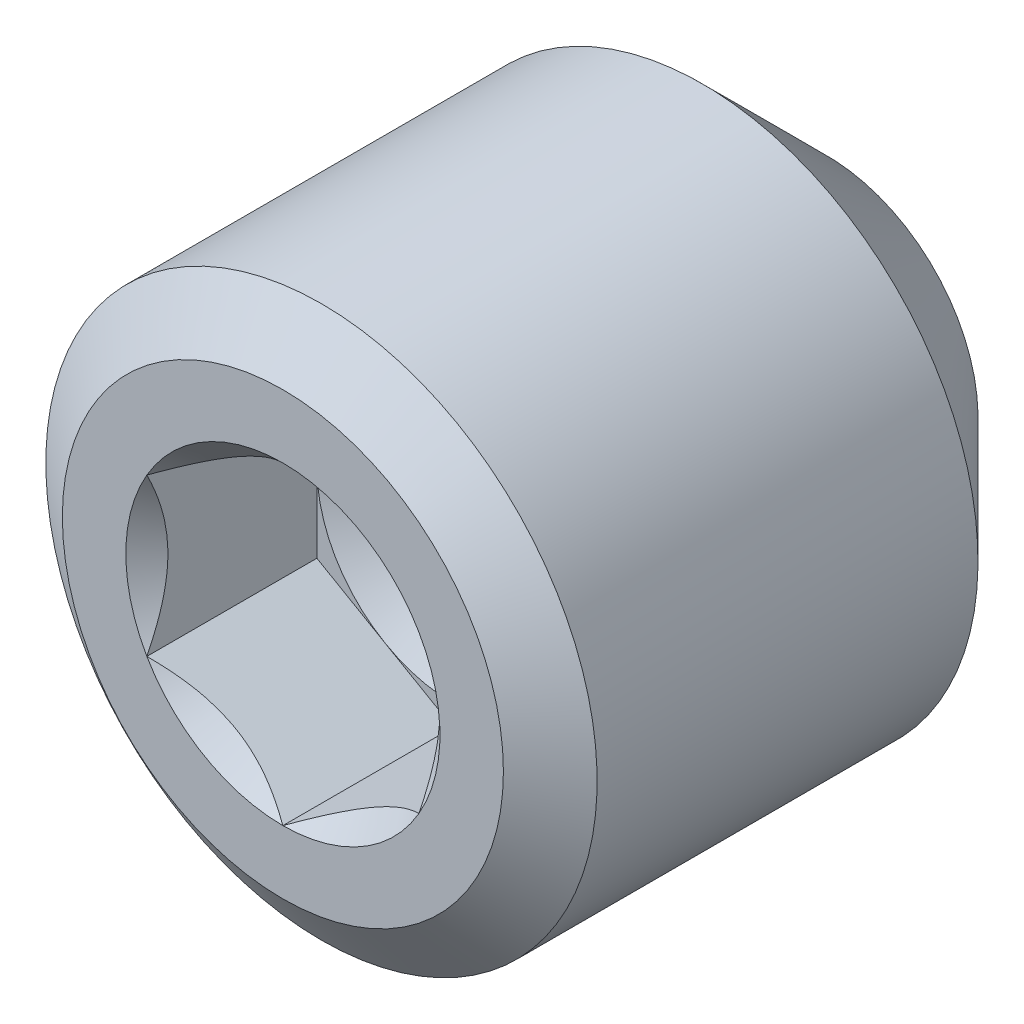
ISO-10303-21;
HEADER;
FILE_DESCRIPTION(('STEP AP214'),'2;1');
FILE_NAME('part.step','',(''),(''),'','','');
FILE_SCHEMA(('AUTOMOTIVE_DESIGN { 1 0 10303 214 1 1 1 1 }'));
ENDSEC;
DATA;
#1=APPLICATION_CONTEXT('core data for automotive mechanical design processes');
#2=APPLICATION_PROTOCOL_DEFINITION('international standard','automotive_design',2000,#1);
#3=PRODUCT_CONTEXT('',#1,'mechanical');
#4=PRODUCT('Part','Part','',(#3));
#5=PRODUCT_RELATED_PRODUCT_CATEGORY('part','',(#4));
#6=PRODUCT_DEFINITION_FORMATION('','',#4);
#7=PRODUCT_DEFINITION_CONTEXT('part definition',#1,'design');
#8=PRODUCT_DEFINITION('design','',#6,#7);
#9=PRODUCT_DEFINITION_SHAPE('','',#8);
#10=(LENGTH_UNIT() NAMED_UNIT(*) SI_UNIT(.MILLI.,.METRE.));
#11=(NAMED_UNIT(*) PLANE_ANGLE_UNIT() SI_UNIT($,.RADIAN.));
#12=(NAMED_UNIT(*) SI_UNIT($,.STERADIAN.) SOLID_ANGLE_UNIT());
#13=UNCERTAINTY_MEASURE_WITH_UNIT(LENGTH_MEASURE(1.E-05),#10,'distance_accuracy_value','');
#14=(GEOMETRIC_REPRESENTATION_CONTEXT(3) GLOBAL_UNCERTAINTY_ASSIGNED_CONTEXT((#13)) GLOBAL_UNIT_ASSIGNED_CONTEXT((#10,
#11,#12)) REPRESENTATION_CONTEXT('',''));
#15=CARTESIAN_POINT('',(0.,0.,0.));
#16=DIRECTION('',(0.,0.,1.));
#17=DIRECTION('',(1.,0.,0.));
#18=AXIS2_PLACEMENT_3D('',#15,#16,#17);
#19=CARTESIAN_POINT('',(0.,0.,0.495727982126937));
#20=DIRECTION('',(0.,0.,1.));
#21=DIRECTION('',(0.,-1.,0.));
#22=AXIS2_PLACEMENT_3D('',#19,#20,#21);
#23=CONICAL_SURFACE('',#22,1.19062499987876,1.04719755103086);
#24=CARTESIAN_POINT('',(2.55795384873636E-10,0.,-0.19167968210354));
#25=VERTEX_POINT('',#24);
#26=VERTEX_LOOP('',#25);
#27=FACE_BOUND('',#26,.T.);
#28=CARTESIAN_POINT('',(0.,0.,0.495727982192574));
#29=DIRECTION('',(0.,0.,1.));
#30=DIRECTION('',(0.,-1.,0.));
#31=AXIS2_PLACEMENT_3D('',#28,#29,#30);
#32=CIRCLE('',#31,1.19062499999245);
#33=CARTESIAN_POINT('',(1.19062499999623,0.,0.495727982183542));
#34=VERTEX_POINT('',#33);
#35=CARTESIAN_POINT('',(0.595312499998112,-1.03111149637757,0.495727982183542));
#36=VERTEX_POINT('',#35);
#37=EDGE_CURVE('E100',#34,#36,#32,.F.);
#38=ORIENTED_EDGE('',*,*,#37,.F.);
#39=CARTESIAN_POINT('',(0.,0.,0.495727982192574));
#40=DIRECTION('',(0.,0.,1.));
#41=DIRECTION('',(0.,-1.,0.));
#42=AXIS2_PLACEMENT_3D('',#39,#40,#41);
#43=CIRCLE('',#42,1.19062499999245);
#44=CARTESIAN_POINT('',(0.59531249999812,1.03111149637759,0.495727982183542));
#45=VERTEX_POINT('',#44);
#46=EDGE_CURVE('E114',#45,#34,#43,.F.);
#47=ORIENTED_EDGE('',*,*,#46,.F.);
#48=CARTESIAN_POINT('',(0.,0.,0.495727982192574));
#49=DIRECTION('',(0.,0.,1.));
#50=DIRECTION('',(0.,-1.,0.));
#51=AXIS2_PLACEMENT_3D('',#48,#49,#50);
#52=CIRCLE('',#51,1.19062499999245);
#53=CARTESIAN_POINT('',(-0.595312499998102,1.0311114963776,0.495727982183538));
#54=VERTEX_POINT('',#53);
#55=EDGE_CURVE('E252',#54,#45,#52,.F.);
#56=ORIENTED_EDGE('',*,*,#55,.F.);
#57=CARTESIAN_POINT('',(0.,0.,0.495727982192574));
#58=DIRECTION('',(0.,0.,1.));
#59=DIRECTION('',(0.,-1.,0.));
#60=AXIS2_PLACEMENT_3D('',#57,#58,#59);
#61=CIRCLE('',#60,1.19062499999245);
#62=CARTESIAN_POINT('',(-1.19062499999622,1.30013777685213E-13,0.495727982183538));
#63=VERTEX_POINT('',#62);
#64=EDGE_CURVE('E151',#63,#54,#61,.F.);
#65=ORIENTED_EDGE('',*,*,#64,.F.);
#66=CARTESIAN_POINT('',(0.,0.,0.495727982192574));
#67=DIRECTION('',(0.,0.,1.));
#68=DIRECTION('',(0.,-1.,0.));
#69=AXIS2_PLACEMENT_3D('',#66,#67,#68);
#70=CIRCLE('',#69,1.19062499999245);
#71=CARTESIAN_POINT('',(-0.595312499998087,-1.03111149637758,0.495727982183542));
#72=VERTEX_POINT('',#71);
#73=EDGE_CURVE('E19',#72,#63,#70,.F.);
#74=ORIENTED_EDGE('',*,*,#73,.F.);
#75=CARTESIAN_POINT('',(0.,0.,0.495727982192574));
#76=DIRECTION('',(0.,0.,1.));
#77=DIRECTION('',(0.,-1.,0.));
#78=AXIS2_PLACEMENT_3D('',#75,#76,#77);
#79=CIRCLE('',#78,1.19062499999245);
#80=EDGE_CURVE('E373',#36,#72,#79,.F.);
#81=ORIENTED_EDGE('',*,*,#80,.F.);
#82=EDGE_LOOP('',(#38,#47,#56,#65,#74,#81));
#83=FACE_BOUND('',#82,.T.);
#84=ADVANCED_FACE('F16',(#27,#83),#23,.F.);
#85=CARTESIAN_POINT('',(-1.190625,2.06222299276171,0.49572798217451));
#86=DIRECTION('',(0.,0.,1.));
#87=DIRECTION('',(0.,-1.,0.));
#88=AXIS2_PLACEMENT_3D('',#85,#86,#87);
#89=PLANE('',#88);
#90=DIRECTION('',(0.,-1.,0.));
#91=VECTOR('',#90,1.);
#92=CARTESIAN_POINT('',(-1.190625,0.687407664253913,0.49572798217451));
#93=LINE('',#92,#91);
#94=CARTESIAN_POINT('',(-1.19062500000001,-0.687407664253882,0.49572798217451));
#95=VERTEX_POINT('',#94);
#96=EDGE_CURVE('E83',#63,#95,#93,.T.);
#97=ORIENTED_EDGE('',*,*,#96,.T.);
#98=DIRECTION('',(0.866025403784438,-0.500000000000001,0.));
#99=VECTOR('',#98,1.);
#100=CARTESIAN_POINT('',(-1.190625,-0.687407664253889,0.49572798217451));
#101=LINE('',#100,#99);
#102=EDGE_CURVE('E167',#95,#72,#101,.T.);
#103=ORIENTED_EDGE('',*,*,#102,.T.);
#104=ORIENTED_EDGE('',*,*,#73,.T.);
#105=EDGE_LOOP('',(#97,#103,#104));
#106=FACE_BOUND('',#105,.T.);
#107=ADVANCED_FACE('F269',(#106),#89,.T.);
#108=CARTESIAN_POINT('',(-1.190625,2.06222299276171,0.49572798217451));
#109=DIRECTION('',(0.,0.,1.));
#110=DIRECTION('',(0.,-1.,0.));
#111=AXIS2_PLACEMENT_3D('',#108,#109,#110);
#112=PLANE('',#111);
#113=DIRECTION('',(0.866025403784438,-0.500000000000001,0.));
#114=VECTOR('',#113,1.);
#115=CARTESIAN_POINT('',(-1.190625,-0.687407664253889,0.495727982174503));
#116=LINE('',#115,#114);
#117=CARTESIAN_POINT('',(0.,-1.37481532850779,0.495727982174507));
#118=VERTEX_POINT('',#117);
#119=EDGE_CURVE('E133',#72,#118,#116,.T.);
#120=ORIENTED_EDGE('',*,*,#119,.T.);
#121=DIRECTION('',(0.866025403784439,0.5,0.));
#122=VECTOR('',#121,1.);
#123=CARTESIAN_POINT('',(0.,-1.37481532850779,0.49572798217451));
#124=LINE('',#123,#122);
#125=EDGE_CURVE('E105',#118,#36,#124,.T.);
#126=ORIENTED_EDGE('',*,*,#125,.T.);
#127=ORIENTED_EDGE('',*,*,#80,.T.);
#128=EDGE_LOOP('',(#120,#126,#127));
#129=FACE_BOUND('',#128,.T.);
#130=ADVANCED_FACE('F267',(#129),#112,.T.);
#131=CARTESIAN_POINT('',(-1.190625,2.06222299276171,0.49572798217451));
#132=DIRECTION('',(0.,0.,1.));
#133=DIRECTION('',(0.,-1.,0.));
#134=AXIS2_PLACEMENT_3D('',#131,#132,#133);
#135=PLANE('',#134);
#136=DIRECTION('',(0.866025403784439,0.5,0.));
#137=VECTOR('',#136,1.);
#138=CARTESIAN_POINT('',(0.,-1.37481532850779,0.49572798217451));
#139=LINE('',#138,#137);
#140=CARTESIAN_POINT('',(1.19062500000001,-0.687407664253884,0.49572798217451));
#141=VERTEX_POINT('',#140);
#142=EDGE_CURVE('E95',#36,#141,#139,.T.);
#143=ORIENTED_EDGE('',*,*,#142,.T.);
#144=DIRECTION('',(0.,1.,0.));
#145=VECTOR('',#144,1.);
#146=CARTESIAN_POINT('',(1.19062500000001,-0.687407664253889,0.49572798217451));
#147=LINE('',#146,#145);
#148=EDGE_CURVE('E98',#141,#34,#147,.T.);
#149=ORIENTED_EDGE('',*,*,#148,.T.);
#150=ORIENTED_EDGE('',*,*,#37,.T.);
#151=EDGE_LOOP('',(#143,#149,#150));
#152=FACE_BOUND('',#151,.T.);
#153=ADVANCED_FACE('F97',(#152),#135,.T.);
#154=CARTESIAN_POINT('',(-1.190625,2.06222299276171,0.49572798217451));
#155=DIRECTION('',(0.,0.,1.));
#156=DIRECTION('',(0.,-1.,0.));
#157=AXIS2_PLACEMENT_3D('',#154,#155,#156);
#158=PLANE('',#157);
#159=DIRECTION('',(0.,1.,0.));
#160=VECTOR('',#159,1.);
#161=CARTESIAN_POINT('',(1.19062500000001,-0.687407664253889,0.495727982174509));
#162=LINE('',#161,#160);
#163=CARTESIAN_POINT('',(1.19062500000003,0.687407664253898,0.495727982174509));
#164=VERTEX_POINT('',#163);
#165=EDGE_CURVE('E113',#34,#164,#162,.T.);
#166=ORIENTED_EDGE('',*,*,#165,.T.);
#167=DIRECTION('',(-0.866025403784438,0.500000000000001,0.));
#168=VECTOR('',#167,1.);
#169=CARTESIAN_POINT('',(1.19062500000001,0.687407664253913,0.49572798217451));
#170=LINE('',#169,#168);
#171=EDGE_CURVE('E124',#164,#45,#170,.T.);
#172=ORIENTED_EDGE('',*,*,#171,.T.);
#173=ORIENTED_EDGE('',*,*,#46,.T.);
#174=EDGE_LOOP('',(#166,#172,#173));
#175=FACE_BOUND('',#174,.T.);
#176=ADVANCED_FACE('F260',(#175),#158,.T.);
#177=CARTESIAN_POINT('',(1.19062500000001,-0.687407664253889,0.49572798217451));
#178=DIRECTION('',(1.,0.,0.));
#179=DIRECTION('',(0.,1.,0.));
#180=AXIS2_PLACEMENT_3D('',#177,#178,#179);
#181=PLANE('',#180);
#182=CARTESIAN_POINT('',(1.19062499999567,0.687407664292412,1.98400923211493));
#183=CARTESIAN_POINT('',(1.19062499999845,0.64046328207789,1.96055894231477));
#184=CARTESIAN_POINT('',(1.19062499999959,0.592738991388445,1.9384779182468));
#185=CARTESIAN_POINT('',(1.19062500000044,0.495406225216116,1.89800295513959));
#186=CARTESIAN_POINT('',(1.19062500000013,0.44578762950972,1.87963356850329));
#187=CARTESIAN_POINT('',(1.1906249999999,0.345116375712698,1.84791358583569));
#188=CARTESIAN_POINT('',(1.19062499999999,0.294069215443057,1.83454600462254));
#189=CARTESIAN_POINT('',(1.19062500000004,0.190855854638069,1.81396603547193));
#190=CARTESIAN_POINT('',(1.19062500000002,0.138693632939681,1.80673461351588));
#191=CARTESIAN_POINT('',(1.19062500000001,0.0719511128628457,1.80190389372895));
#192=CARTESIAN_POINT('',(1.19062500000001,0.0575681065477679,1.80112291749238));
#193=CARTESIAN_POINT('',(1.19062500000001,0.0287907386471924,1.80008032792779));
#194=CARTESIAN_POINT('',(1.19062500000001,0.0143963874866042,1.79981843246661));
#195=CARTESIAN_POINT('',(1.19062500000001,-0.0361321030513867,1.79982008619966));
#196=CARTESIAN_POINT('',(1.19062500000001,-0.0722770331511759,1.80147394594884));
#197=CARTESIAN_POINT('',(1.19062500000001,-0.144284982609329,1.80799116289963));
#198=CARTESIAN_POINT('',(1.19062500000001,-0.180147787674807,1.81285675864882));
#199=CARTESIAN_POINT('',(1.19062500000001,-0.287258251714067,1.83196696983393));
#200=CARTESIAN_POINT('',(1.19062500000001,-0.35772529740189,1.85072176782421));
#201=CARTESIAN_POINT('',(1.19062500000001,-0.471552892507442,1.88908925370762));
#202=CARTESIAN_POINT('',(1.19062500000001,-0.515840765958847,1.90614997876308));
#203=CARTESIAN_POINT('',(1.19062500000001,-0.602739573147029,1.94312607455083));
#204=CARTESIAN_POINT('',(1.19062500000001,-0.645362139970547,1.96301390794479));
#205=CARTESIAN_POINT('',(1.19062500000001,-0.687407664293118,1.98400923211292));
#206=B_SPLINE_CURVE_WITH_KNOTS('',3,(#182,#183,#184,#185,#186,#187,#188,#189,#190,#191,#192,
#193,#194,#195,#196,#197,#198,#199,#200,#201,#202,#203,#204,#205),.UNSPECIFIED.,.F.,.F.,(4,2,2,
2,2,2,2,2,2,2,2,4),(0.,0.157535403142992,0.316081041540045,0.474083294698365,0.631593623243647,
0.674799715139207,0.717982317014592,0.826362160391399,0.934817623300469,1.15262451060987,
1.29491478060776,1.43590359051227),.UNSPECIFIED.);
#207=CARTESIAN_POINT('',(1.19062500005789,0.687407664240221,1.98400923213658));
#208=VERTEX_POINT('',#207);
#209=CARTESIAN_POINT('',(1.19062500002894,-0.687407664270611,1.98400923212671));
#210=VERTEX_POINT('',#209);
#211=EDGE_CURVE('E159',#208,#210,#206,.T.);
#212=ORIENTED_EDGE('',*,*,#211,.F.);
#213=DIRECTION('',(0.,0.,1.));
#214=VECTOR('',#213,1.);
#215=CARTESIAN_POINT('',(1.19062500000003,0.687407664253898,0.49572798217451));
#216=LINE('',#215,#214);
#217=EDGE_CURVE('E139',#208,#164,#216,.F.);
#218=ORIENTED_EDGE('',*,*,#217,.T.);
#219=ORIENTED_EDGE('',*,*,#165,.F.);
#220=ORIENTED_EDGE('',*,*,#148,.F.);
#221=DIRECTION('',(0.,0.,1.));
#222=VECTOR('',#221,1.);
#223=CARTESIAN_POINT('',(1.19062500000001,-0.687407664253884,0.49572798217451));
#224=LINE('',#223,#222);
#225=EDGE_CURVE('E104',#141,#210,#224,.T.);
#226=ORIENTED_EDGE('',*,*,#225,.T.);
#227=EDGE_LOOP('',(#212,#218,#219,#220,#226));
#228=FACE_BOUND('',#227,.T.);
#229=ADVANCED_FACE('F110',(#228),#181,.F.);
#230=CARTESIAN_POINT('',(-1.190625,2.06222299276171,0.49572798217451));
#231=DIRECTION('',(0.,0.,1.));
#232=DIRECTION('',(0.,-1.,0.));
#233=AXIS2_PLACEMENT_3D('',#230,#231,#232);
#234=PLANE('',#233);
#235=DIRECTION('',(-0.866025403784438,0.500000000000001,0.));
#236=VECTOR('',#235,1.);
#237=CARTESIAN_POINT('',(1.19062500000001,0.687407664253913,0.495727982174503));
#238=LINE('',#237,#236);
#239=CARTESIAN_POINT('',(0.,1.37481532850782,0.495727982174503));
#240=VERTEX_POINT('',#239);
#241=EDGE_CURVE('E136',#45,#240,#238,.T.);
#242=ORIENTED_EDGE('',*,*,#241,.T.);
#243=DIRECTION('',(-0.866025403784439,-0.5,0.));
#244=VECTOR('',#243,1.);
#245=CARTESIAN_POINT('',(0.,1.37481532850781,0.495727982174503));
#246=LINE('',#245,#244);
#247=EDGE_CURVE('E142',#240,#54,#246,.T.);
#248=ORIENTED_EDGE('',*,*,#247,.T.);
#249=ORIENTED_EDGE('',*,*,#55,.T.);
#250=EDGE_LOOP('',(#242,#248,#249));
#251=FACE_BOUND('',#250,.T.);
#252=ADVANCED_FACE('F259',(#251),#234,.T.);
#253=CARTESIAN_POINT('',(-1.190625,2.06222299276171,0.49572798217451));
#254=DIRECTION('',(0.,0.,1.));
#255=DIRECTION('',(0.,-1.,0.));
#256=AXIS2_PLACEMENT_3D('',#253,#254,#255);
#257=PLANE('',#256);
#258=DIRECTION('',(-0.866025403784439,-0.5,0.));
#259=VECTOR('',#258,1.);
#260=CARTESIAN_POINT('',(0.,1.37481532850781,0.495727982174501));
#261=LINE('',#260,#259);
#262=CARTESIAN_POINT('',(-1.190625,0.687407664253916,0.495727982174502));
#263=VERTEX_POINT('',#262);
#264=EDGE_CURVE('E145',#54,#263,#261,.T.);
#265=ORIENTED_EDGE('',*,*,#264,.T.);
#266=DIRECTION('',(0.,-1.,0.));
#267=VECTOR('',#266,1.);
#268=CARTESIAN_POINT('',(-1.190625,0.687407664253913,0.495727982174503));
#269=LINE('',#268,#267);
#270=EDGE_CURVE('E148',#263,#63,#269,.T.);
#271=ORIENTED_EDGE('',*,*,#270,.T.);
#272=ORIENTED_EDGE('',*,*,#64,.T.);
#273=EDGE_LOOP('',(#265,#271,#272));
#274=FACE_BOUND('',#273,.T.);
#275=ADVANCED_FACE('F359',(#274),#257,.T.);
#276=CARTESIAN_POINT('',(-1.190625,0.687407664253913,0.495727982174503));
#277=DIRECTION('',(-1.,0.,0.));
#278=DIRECTION('',(0.,-1.,0.));
#279=AXIS2_PLACEMENT_3D('',#276,#277,#278);
#280=PLANE('',#279);
#281=CARTESIAN_POINT('',(-1.19062499999689,0.687407664295069,1.98400923211557));
#282=CARTESIAN_POINT('',(-1.19062499999888,0.640154592187732,1.96040536744382));
#283=CARTESIAN_POINT('',(-1.1906249999997,0.592111444465279,1.93818802847305));
#284=CARTESIAN_POINT('',(-1.1906250000003,0.494146535985991,1.89750902941694));
#285=CARTESIAN_POINT('',(-1.19062500000008,0.444215463852093,1.87906999571823));
#286=CARTESIAN_POINT('',(-1.19062499999992,0.34353191261821,1.84748380274731));
#287=CARTESIAN_POINT('',(-1.19062499999998,0.292805060660136,1.83425727427473));
#288=CARTESIAN_POINT('',(-1.19062500000002,0.19023488957445,1.81387930355028));
#289=CARTESIAN_POINT('',(-1.190625,0.138394701629495,1.80671265556526));
#290=CARTESIAN_POINT('',(-1.19062499999999,0.0490434171471756,1.80024610055994));
#291=CARTESIAN_POINT('',(-1.190625,0.0116476312291625,1.79928918177737));
#292=CARTESIAN_POINT('',(-1.190625,-0.0630781169061416,1.80090396128143));
#293=CARTESIAN_POINT('',(-1.190625,-0.100408062759505,1.80347643902957));
#294=CARTESIAN_POINT('',(-1.190625,-0.174707550763351,1.81200130363095));
#295=CARTESIAN_POINT('',(-1.190625,-0.211676725216807,1.81795683341918));
#296=CARTESIAN_POINT('',(-1.190625,-0.284997830944034,1.83292705321312));
#297=CARTESIAN_POINT('',(-1.190625,-0.321349490320898,1.84194305589422));
#298=CARTESIAN_POINT('',(-1.190625,-0.414409407701737,1.86868846791361));
#299=CARTESIAN_POINT('',(-1.190625,-0.47053205911329,1.88842523325998));
#300=CARTESIAN_POINT('',(-1.190625,-0.580581647456373,1.93288237138799));
#301=CARTESIAN_POINT('',(-1.190625,-0.634515062273283,1.95758652132262));
#302=CARTESIAN_POINT('',(-1.190625,-0.687407664295433,1.98400923211406));
#303=B_SPLINE_CURVE_WITH_KNOTS('',3,(#281,#282,#283,#284,#285,#286,#287,#288,#289,#290,#291,
#292,#293,#294,#295,#296,#297,#298,#299,#300,#301,#302),.UNSPECIFIED.,.F.,.F.,(4,2,2,2,2,2,2,2,
2,2,4),(0.,0.158570945782174,0.318065397827539,0.475027617267219,0.631594801071171,
0.743660160759135,0.855750273884749,0.967944692071428,1.08018729279008,1.25836291045195,
1.43596581394394),.UNSPECIFIED.);
#304=CARTESIAN_POINT('',(-1.19062500002893,0.687407664270642,1.98400923212671));
#305=VERTEX_POINT('',#304);
#306=CARTESIAN_POINT('',(-1.19062500005789,-0.687407664241365,1.98400923213716));
#307=VERTEX_POINT('',#306);
#308=EDGE_CURVE('E314',#305,#307,#303,.T.);
#309=ORIENTED_EDGE('',*,*,#308,.T.);
#310=DIRECTION('',(0.,0.,1.));
#311=VECTOR('',#310,1.);
#312=CARTESIAN_POINT('',(-1.19062500000001,-0.687407664253882,0.49572798217451));
#313=LINE('',#312,#311);
#314=EDGE_CURVE('E131',#307,#95,#313,.F.);
#315=ORIENTED_EDGE('',*,*,#314,.T.);
#316=ORIENTED_EDGE('',*,*,#96,.F.);
#317=ORIENTED_EDGE('',*,*,#270,.F.);
#318=DIRECTION('',(0.,0.,1.));
#319=VECTOR('',#318,1.);
#320=CARTESIAN_POINT('',(-1.190625,0.687407664253916,0.495727982174503));
#321=LINE('',#320,#319);
#322=EDGE_CURVE('E155',#263,#305,#321,.T.);
#323=ORIENTED_EDGE('',*,*,#322,.T.);
#324=EDGE_LOOP('',(#309,#315,#316,#317,#323));
#325=FACE_BOUND('',#324,.T.);
#326=ADVANCED_FACE('F331',(#325),#280,.F.);
#327=CARTESIAN_POINT('',(-1.190625,-0.687407664253889,0.49572798217451));
#328=DIRECTION('',(-0.500000000000001,-0.866025403784438,0.));
#329=DIRECTION('',(0.866025403784438,-0.500000000000001,0.));
#330=AXIS2_PLACEMENT_3D('',#327,#328,#329);
#331=PLANE('',#330);
#332=CARTESIAN_POINT('',(-1.19062500003409,-0.687407664230629,1.98400923211556));
#333=CARTESIAN_POINT('',(-1.14970263918327,-0.711034200286016,1.96040536744382));
#334=CARTESIAN_POINT('',(-1.10809605277826,-0.73505577414795,1.93818802847304));
#335=CARTESIAN_POINT('',(-1.02325595335608,-0.784038228388114,1.89750902941694));
#336=CARTESIAN_POINT('',(-0.980014376449825,-0.809003764454871,1.87906999571824));
#337=CARTESIAN_POINT('',(-0.892819863337972,-0.859345540071674,1.84748380274731));
#338=CARTESIAN_POINT('',(-0.848889120888296,-0.884708966050761,1.83425727427474));
#339=CARTESIAN_POINT('',(-0.760060747057598,-0.93599405159364,1.81387930355029));
#340=CARTESIAN_POINT('',(-0.7151658273603,-0.961914145566103,1.80671265556527));
#341=CARTESIAN_POINT('',(-0.637785345137838,-1.00658978780726,1.80024610055994));
#342=CARTESIAN_POINT('',(-0.605399644538355,-1.02528768076626,1.79928918177737));
#343=CARTESIAN_POINT('',(-0.540685248336385,-1.06265055483392,1.80090396128143));
#344=CARTESIAN_POINT('',(-0.508356566905474,-1.0813155277606,1.80347643902958));
#345=CARTESIAN_POINT('',(-0.444011322805966,-1.11846527176252,1.81200130363096));
#346=CARTESIAN_POINT('',(-0.411995078572333,-1.13694985898925,1.81795683341919));
#347=CARTESIAN_POINT('',(-0.348497138378991,-1.17361041185286,1.83292705321313));
#348=CARTESIAN_POINT('',(-0.317015677888907,-1.1917862415413,1.84194305589423));
#349=CARTESIAN_POINT('',(-0.23642342536302,-1.23831620023172,1.86868846791362));
#350=CARTESIAN_POINT('',(-0.187819783512878,-1.26637752593749,1.88842523325998));
#351=CARTESIAN_POINT('',(-0.0925140443317499,-1.32140232010903,1.932882371388));
#352=CARTESIAN_POINT('',(-0.0458063369874632,-1.34836902751749,1.95758652132262));
#353=CARTESIAN_POINT('',(3.59776575595635E-11,-1.37481532852856,1.98400923211406));
#354=B_SPLINE_CURVE_WITH_KNOTS('',3,(#332,#333,#334,#335,#336,#337,#338,#339,#340,#341,#342,
#343,#344,#345,#346,#347,#348,#349,#350,#351,#352,#353),.UNSPECIFIED.,.F.,.F.,(4,2,2,2,2,2,2,2,
2,2,4),(0.,0.158570945782172,0.318065397827535,0.475027617267213,0.631594801071163,
0.743660160759127,0.855750273884742,0.967944692071422,1.08018729279007,1.25836291045194,
1.43596581394393),.UNSPECIFIED.);
#355=CARTESIAN_POINT('',(-3.97893440011964E-11,-1.37481532855166,1.98400923213716));
#356=VERTEX_POINT('',#355);
#357=EDGE_CURVE('E319',#307,#356,#354,.T.);
#358=ORIENTED_EDGE('',*,*,#357,.T.);
#359=DIRECTION('',(0.,0.,1.));
#360=VECTOR('',#359,1.);
#361=CARTESIAN_POINT('',(0.,-1.3748153285078,0.49572798217451));
#362=LINE('',#361,#360);
#363=EDGE_CURVE('E121',#356,#118,#362,.F.);
#364=ORIENTED_EDGE('',*,*,#363,.T.);
#365=ORIENTED_EDGE('',*,*,#119,.F.);
#366=ORIENTED_EDGE('',*,*,#102,.F.);
#367=ORIENTED_EDGE('',*,*,#314,.F.);
#368=EDGE_LOOP('',(#358,#364,#365,#366,#367));
#369=FACE_BOUND('',#368,.T.);
#370=ADVANCED_FACE('F352',(#369),#331,.F.);
#371=CARTESIAN_POINT('',(0.,-1.37481532850779,0.49572798217451));
#372=DIRECTION('',(0.5,-0.866025403784439,0.));
#373=DIRECTION('',(0.866025403784439,0.5,0.));
#374=AXIS2_PLACEMENT_3D('',#371,#372,#373);
#375=PLANE('',#374);
#376=CARTESIAN_POINT('',(-3.7187299035962E-11,-1.37481532852568,1.98400923211557));
#377=CARTESIAN_POINT('',(0.0409223608156151,-1.35118879247373,1.96040536744382));
#378=CARTESIAN_POINT('',(0.0825289472214342,-1.32716721861321,1.93818802847305));
#379=CARTESIAN_POINT('',(0.167369046644212,-1.27818476437409,1.89750902941694));
#380=CARTESIAN_POINT('',(0.210610623550247,-1.25321922830695,1.87906999571824));
#381=CARTESIAN_POINT('',(0.297805136661942,-1.20287745268987,1.84748380274731));
#382=CARTESIAN_POINT('',(0.341735879111678,-1.17751402671088,1.83425727427474));
#383=CARTESIAN_POINT('',(0.430564252942422,-1.12622894116808,1.81387930355029));
#384=CARTESIAN_POINT('',(0.475459172639706,-1.10030884719558,1.80671265556527));
#385=CARTESIAN_POINT('',(0.552839654862164,-1.05563320495441,1.80024610055994));
#386=CARTESIAN_POINT('',(0.58522535546165,-1.03693531199541,1.79928918177737));
#387=CARTESIAN_POINT('',(0.649939751663623,-0.999572437927758,1.80090396128143));
#388=CARTESIAN_POINT('',(0.682268433094534,-0.980907465001075,1.80347643902958));
#389=CARTESIAN_POINT('',(0.746613677194042,-0.943757720999152,1.81200130363096));
#390=CARTESIAN_POINT('',(0.778629921427674,-0.925273133772424,1.81795683341919));
#391=CARTESIAN_POINT('',(0.842127861621015,-0.888612580908812,1.83292705321313));
#392=CARTESIAN_POINT('',(0.873609322111098,-0.87043675122038,1.84194305589423));
#393=CARTESIAN_POINT('',(0.954201574636604,-0.82390679253018,1.86868846791349));
#394=CARTESIAN_POINT('',(1.00280521648638,-0.795845466824616,1.88842523325968));
#395=CARTESIAN_POINT('',(1.0981109556668,-0.740820672653482,1.93288237138728));
#396=CARTESIAN_POINT('',(1.14481866301075,-0.713853965245223,1.95758652132166));
#397=CARTESIAN_POINT('',(1.19062500003387,-0.687407664234335,1.98400923211284));
#398=B_SPLINE_CURVE_WITH_KNOTS('',3,(#376,#377,#378,#379,#380,#381,#382,#383,#384,#385,#386,
#387,#388,#389,#390,#391,#392,#393,#394,#395,#396,#397),.UNSPECIFIED.,.F.,.F.,(4,2,2,2,2,2,2,2,
2,2,4),(0.,0.158570945782166,0.318065397827523,0.475027617267209,0.631594801071167,
0.743660160759134,0.855750273884751,0.967944692071429,1.08018729279008,1.25836291045058,
1.43596581394121),.UNSPECIFIED.);
#399=EDGE_CURVE('E119',#356,#210,#398,.T.);
#400=ORIENTED_EDGE('',*,*,#399,.T.);
#401=ORIENTED_EDGE('',*,*,#225,.F.);
#402=ORIENTED_EDGE('',*,*,#142,.F.);
#403=ORIENTED_EDGE('',*,*,#125,.F.);
#404=ORIENTED_EDGE('',*,*,#363,.F.);
#405=EDGE_LOOP('',(#400,#401,#402,#403,#404));
#406=FACE_BOUND('',#405,.T.);
#407=ADVANCED_FACE('F116',(#406),#375,.F.);
#408=CARTESIAN_POINT('',(1.19062500000001,0.687407664253913,0.49572798217451));
#409=DIRECTION('',(0.500000000000001,0.866025403784438,0.));
#410=DIRECTION('',(-0.866025403784438,0.500000000000001,0.));
#411=AXIS2_PLACEMENT_3D('',#408,#409,#410);
#412=PLANE('',#411);
#413=CARTESIAN_POINT('',(1.19062500003121,0.687407664230863,1.98400923211496));
#414=CARTESIAN_POINT('',(1.14970263918109,0.711034200286776,1.96040536744301));
#415=CARTESIAN_POINT('',(1.10809605277648,0.735055774148869,1.93818802847223));
#416=CARTESIAN_POINT('',(1.02325595335481,0.784038228389021,1.89750902941629));
#417=CARTESIAN_POINT('',(0.98001437644867,0.809003764455603,1.87906999571776));
#418=CARTESIAN_POINT('',(0.892819863337155,0.859345540072137,1.84748380274708));
#419=CARTESIAN_POINT('',(0.848889120887694,0.884708966051127,1.83425727427459));
#420=CARTESIAN_POINT('',(0.760060747057411,0.935994051593785,1.81387930355026));
#421=CARTESIAN_POINT('',(0.715165827360314,0.961914145566125,1.80671265556529));
#422=CARTESIAN_POINT('',(0.637785345138079,1.00658978780714,1.80024610055996));
#423=CARTESIAN_POINT('',(0.605399644538619,1.02528768076614,1.79928918177738));
#424=CARTESIAN_POINT('',(0.540685248336694,1.06265055483377,1.80090396128142));
#425=CARTESIAN_POINT('',(0.508356566905804,1.08131552776044,1.80347643902955));
#426=CARTESIAN_POINT('',(0.444011322806335,1.11846527176234,1.8120013036309));
#427=CARTESIAN_POINT('',(0.411995078572721,1.13694985898905,1.81795683341912));
#428=CARTESIAN_POINT('',(0.348497138379412,1.17361041185265,1.83292705321302));
#429=CARTESIAN_POINT('',(0.317015677889345,1.19178624154107,1.8419430558941));
#430=CARTESIAN_POINT('',(0.236423425363389,1.23831620023153,1.86868846791348));
#431=CARTESIAN_POINT('',(0.187819783513164,1.26637752593735,1.88842523325986));
#432=CARTESIAN_POINT('',(0.0925140443318827,1.32140232010898,1.93288237138793));
#433=CARTESIAN_POINT('',(0.0458063369875248,1.34836902751748,1.9575865213226));
#434=CARTESIAN_POINT('',(-3.59844204254258E-11,1.37481532852859,1.98400923211407));
#435=B_SPLINE_CURVE_WITH_KNOTS('',3,(#413,#414,#415,#416,#417,#418,#419,#420,#421,#422,#423,
#424,#425,#426,#427,#428,#429,#430,#431,#432,#433,#434),.UNSPECIFIED.,.F.,.F.,(4,2,2,2,2,2,2,2,
2,2,4),(0.,0.158570945781483,0.318065397826116,0.475027617265063,0.631594801068299,
0.743660160756186,0.855750273881723,0.967944692068335,1.08018729278692,1.25836291044907,
1.43596581394133),.UNSPECIFIED.);
#436=CARTESIAN_POINT('',(3.97830534634665E-11,1.37481532855168,1.98400923213717));
#437=VERTEX_POINT('',#436);
#438=EDGE_CURVE('E34',#208,#437,#435,.T.);
#439=ORIENTED_EDGE('',*,*,#438,.T.);
#440=DIRECTION('',(0.,0.,1.));
#441=VECTOR('',#440,1.);
#442=CARTESIAN_POINT('',(0.,1.37481532850782,0.495727982174503));
#443=LINE('',#442,#441);
#444=EDGE_CURVE('E312',#437,#240,#443,.F.);
#445=ORIENTED_EDGE('',*,*,#444,.T.);
#446=ORIENTED_EDGE('',*,*,#241,.F.);
#447=ORIENTED_EDGE('',*,*,#171,.F.);
#448=ORIENTED_EDGE('',*,*,#217,.F.);
#449=EDGE_LOOP('',(#439,#445,#446,#447,#448));
#450=FACE_BOUND('',#449,.T.);
#451=ADVANCED_FACE('F351',(#450),#412,.F.);
#452=CARTESIAN_POINT('',(0.,1.37481532850781,0.495727982174503));
#453=DIRECTION('',(-0.5,0.866025403784439,0.));
#454=DIRECTION('',(-0.866025403784439,-0.5,0.));
#455=AXIS2_PLACEMENT_3D('',#452,#453,#454);
#456=PLANE('',#455);
#457=CARTESIAN_POINT('',(3.7170576648238E-11,1.37481532852571,1.98400923211556));
#458=CARTESIAN_POINT('',(-0.0409223608156309,1.35118879247375,1.96040536744381));
#459=CARTESIAN_POINT('',(-0.0825289472214504,1.32716721861323,1.93818802847304));
#460=CARTESIAN_POINT('',(-0.16736904664423,1.2781847643741,1.89750902941694));
#461=CARTESIAN_POINT('',(-0.210610623550268,1.25321922830696,1.87906999571824));
#462=CARTESIAN_POINT('',(-0.297805136661962,1.20287745268989,1.84748380274731));
#463=CARTESIAN_POINT('',(-0.341735879111695,1.1775140267109,1.83425727427474));
#464=CARTESIAN_POINT('',(-0.430564252942434,1.12622894116809,1.81387930355029));
#465=CARTESIAN_POINT('',(-0.475459172639716,1.1003088471956,1.80671265556527));
#466=CARTESIAN_POINT('',(-0.552839654862171,1.05563320495443,1.80024610055995));
#467=CARTESIAN_POINT('',(-0.585225355461656,1.03693531199543,1.79928918177738));
#468=CARTESIAN_POINT('',(-0.649939751663629,0.999572437927779,1.80090396128144));
#469=CARTESIAN_POINT('',(-0.682268433094539,0.980907465001097,1.80347643902958));
#470=CARTESIAN_POINT('',(-0.746613677194047,0.943757720999173,1.81200130363096));
#471=CARTESIAN_POINT('',(-0.77862992142768,0.925273133772445,1.81795683341919));
#472=CARTESIAN_POINT('',(-0.842127861621023,0.888612580908832,1.83292705321314));
#473=CARTESIAN_POINT('',(-0.873609322111106,0.870436751220399,1.84194305589423));
#474=CARTESIAN_POINT('',(-0.954201574636989,0.823906792529982,1.86868846791362));
#475=CARTESIAN_POINT('',(-1.00280521648713,0.795845466824209,1.88842523325999));
#476=CARTESIAN_POINT('',(-1.09811095566825,0.740820672652673,1.932882371388));
#477=CARTESIAN_POINT('',(-1.14481866301253,0.713853965244221,1.95758652132262));
#478=CARTESIAN_POINT('',(-1.19062500003597,0.687407664233148,1.98400923211406));
#479=B_SPLINE_CURVE_WITH_KNOTS('',3,(#457,#458,#459,#460,#461,#462,#463,#464,#465,#466,#467,
#468,#469,#470,#471,#472,#473,#474,#475,#476,#477,#478),.UNSPECIFIED.,.F.,.F.,(4,2,2,2,2,2,2,2,
2,2,4),(0.,0.158570945782171,0.318065397827532,0.47502761726721,0.631594801071159,
0.743660160759124,0.855750273884739,0.967944692071419,1.08018729279007,1.25836291045192,
1.4359658139439),.UNSPECIFIED.);
#480=EDGE_CURVE('E207',#437,#305,#479,.T.);
#481=ORIENTED_EDGE('',*,*,#480,.T.);
#482=ORIENTED_EDGE('',*,*,#322,.F.);
#483=ORIENTED_EDGE('',*,*,#264,.F.);
#484=ORIENTED_EDGE('',*,*,#247,.F.);
#485=ORIENTED_EDGE('',*,*,#444,.F.);
#486=EDGE_LOOP('',(#481,#482,#483,#484,#485));
#487=FACE_BOUND('',#486,.T.);
#488=ADVANCED_FACE('F221',(#487),#456,.F.);
#489=CARTESIAN_POINT('',(0.,0.,1.98400923216013));
#490=DIRECTION('',(0.,0.,1.));
#491=DIRECTION('',(1.,0.,0.));
#492=AXIS2_PLACEMENT_3D('',#489,#490,#491);
#493=CONICAL_SURFACE('',#492,1.37481532857464,0.785398163397448);
#494=ORIENTED_EDGE('',*,*,#308,.F.);
#495=CARTESIAN_POINT('',(0.,0.,1.98400923216013));
#496=DIRECTION('',(0.,0.,1.));
#497=DIRECTION('',(1.,0.,0.));
#498=AXIS2_PLACEMENT_3D('',#495,#496,#497);
#499=CIRCLE('',#498,1.37481532857464);
#500=EDGE_CURVE('E204',#305,#307,#499,.T.);
#501=ORIENTED_EDGE('',*,*,#500,.T.);
#502=EDGE_LOOP('',(#494,#501));
#503=FACE_BOUND('',#502,.T.);
#504=ADVANCED_FACE('F315',(#503),#493,.F.);
#505=CARTESIAN_POINT('',(0.,0.,1.98400923216013));
#506=DIRECTION('',(0.,0.,1.));
#507=DIRECTION('',(1.,0.,0.));
#508=AXIS2_PLACEMENT_3D('',#505,#506,#507);
#509=CONICAL_SURFACE('',#508,1.37481532857464,0.785398163397448);
#510=ORIENTED_EDGE('',*,*,#357,.F.);
#511=CARTESIAN_POINT('',(0.,0.,1.98400923216013));
#512=DIRECTION('',(0.,0.,1.));
#513=DIRECTION('',(1.,0.,0.));
#514=AXIS2_PLACEMENT_3D('',#511,#512,#513);
#515=CIRCLE('',#514,1.37481532857464);
#516=EDGE_CURVE('E201',#307,#356,#515,.T.);
#517=ORIENTED_EDGE('',*,*,#516,.T.);
#518=EDGE_LOOP('',(#510,#517));
#519=FACE_BOUND('',#518,.T.);
#520=ADVANCED_FACE('F335',(#519),#509,.F.);
#521=CARTESIAN_POINT('',(0.,0.,1.98400923216013));
#522=DIRECTION('',(0.,0.,1.));
#523=DIRECTION('',(1.,0.,0.));
#524=AXIS2_PLACEMENT_3D('',#521,#522,#523);
#525=CONICAL_SURFACE('',#524,1.37481532857464,0.785398163397448);
#526=ORIENTED_EDGE('',*,*,#399,.F.);
#527=CARTESIAN_POINT('',(0.,0.,1.98400923216013));
#528=DIRECTION('',(0.,0.,1.));
#529=DIRECTION('',(1.,0.,0.));
#530=AXIS2_PLACEMENT_3D('',#527,#528,#529);
#531=CIRCLE('',#530,1.37481532857464);
#532=EDGE_CURVE('E199',#356,#210,#531,.T.);
#533=ORIENTED_EDGE('',*,*,#532,.T.);
#534=EDGE_LOOP('',(#526,#533));
#535=FACE_BOUND('',#534,.T.);
#536=ADVANCED_FACE('F240',(#535),#525,.F.);
#537=CARTESIAN_POINT('',(0.,0.,1.98400923216013));
#538=DIRECTION('',(0.,0.,1.));
#539=DIRECTION('',(1.,0.,0.));
#540=AXIS2_PLACEMENT_3D('',#537,#538,#539);
#541=CONICAL_SURFACE('',#540,1.37481532857464,0.785398163550834);
#542=CARTESIAN_POINT('',(0.,0.,1.98400923216013));
#543=DIRECTION('',(0.,0.,1.));
#544=DIRECTION('',(1.,0.,0.));
#545=AXIS2_PLACEMENT_3D('',#542,#543,#544);
#546=CIRCLE('',#545,1.37481532857464);
#547=EDGE_CURVE('E196',#210,#208,#546,.T.);
#548=ORIENTED_EDGE('',*,*,#547,.T.);
#549=ORIENTED_EDGE('',*,*,#211,.T.);
#550=EDGE_LOOP('',(#548,#549));
#551=FACE_BOUND('',#550,.T.);
#552=ADVANCED_FACE('F235',(#551),#541,.F.);
#553=CARTESIAN_POINT('',(0.,0.,1.98400923216013));
#554=DIRECTION('',(0.,0.,1.));
#555=DIRECTION('',(1.,0.,0.));
#556=AXIS2_PLACEMENT_3D('',#553,#554,#555);
#557=CONICAL_SURFACE('',#556,1.37481532857464,0.785398163397448);
#558=ORIENTED_EDGE('',*,*,#438,.F.);
#559=CARTESIAN_POINT('',(0.,0.,1.98400923216013));
#560=DIRECTION('',(0.,0.,1.));
#561=DIRECTION('',(1.,0.,0.));
#562=AXIS2_PLACEMENT_3D('',#559,#560,#561);
#563=CIRCLE('',#562,1.37481532857464);
#564=EDGE_CURVE('E193',#208,#437,#563,.T.);
#565=ORIENTED_EDGE('',*,*,#564,.T.);
#566=EDGE_LOOP('',(#558,#565));
#567=FACE_BOUND('',#566,.T.);
#568=ADVANCED_FACE('F229',(#567),#557,.F.);
#569=CARTESIAN_POINT('',(0.,0.,1.98400923216013));
#570=DIRECTION('',(0.,0.,1.));
#571=DIRECTION('',(1.,0.,0.));
#572=AXIS2_PLACEMENT_3D('',#569,#570,#571);
#573=CONICAL_SURFACE('',#572,1.37481532857464,0.785398163397448);
#574=ORIENTED_EDGE('',*,*,#480,.F.);
#575=CARTESIAN_POINT('',(0.,0.,1.98400923216013));
#576=DIRECTION('',(0.,0.,1.));
#577=DIRECTION('',(1.,0.,0.));
#578=AXIS2_PLACEMENT_3D('',#575,#576,#577);
#579=CIRCLE('',#578,1.37481532857464);
#580=EDGE_CURVE('E190',#437,#305,#579,.T.);
#581=ORIENTED_EDGE('',*,*,#580,.T.);
#582=EDGE_LOOP('',(#574,#581));
#583=FACE_BOUND('',#582,.T.);
#584=ADVANCED_FACE('F224',(#583),#573,.F.);
#585=CARTESIAN_POINT('',(0.,1.32223931889029,-2.77849076782551));
#586=DIRECTION('',(0.,0.,1.));
#587=DIRECTION('',(0.,-1.,0.));
#588=AXIS2_PLACEMENT_3D('',#585,#586,#587);
#589=PLANE('',#588);
#590=CARTESIAN_POINT('',(0.,0.,-2.77849076780968));
#591=DIRECTION('',(0.,0.,1.));
#592=DIRECTION('',(0.,-1.,0.));
#593=AXIS2_PLACEMENT_3D('',#590,#591,#592);
#594=CIRCLE('',#593,1.3222393188812);
#595=CARTESIAN_POINT('',(0.,-1.3222393188812,-2.77849076780967));
#596=VERTEX_POINT('',#595);
#597=EDGE_CURVE('E187',#596,#596,#594,.T.);
#598=ORIENTED_EDGE('',*,*,#597,.F.);
#599=EDGE_LOOP('',(#598));
#600=FACE_BOUND('',#599,.T.);
#601=ADVANCED_FACE('F228',(#600),#589,.F.);
#602=CARTESIAN_POINT('',(0.,0.,1.98400923217451));
#603=DIRECTION('',(0.,0.,-1.));
#604=DIRECTION('',(0.,1.,0.));
#605=AXIS2_PLACEMENT_3D('',#602,#603,#604);
#606=PLANE('',#605);
#607=CARTESIAN_POINT('',(0.,0.,1.98400923216014));
#608=DIRECTION('',(0.,0.,-1.));
#609=DIRECTION('',(0.,1.,0.));
#610=AXIS2_PLACEMENT_3D('',#607,#608,#609);
#611=CIRCLE('',#610,1.93040000004882);
#612=CARTESIAN_POINT('',(0.,1.93040000004885,1.98400923216013));
#613=VERTEX_POINT('',#612);
#614=EDGE_CURVE('E184',#613,#613,#611,.T.);
#615=ORIENTED_EDGE('',*,*,#614,.F.);
#616=EDGE_LOOP('',(#615));
#617=FACE_BOUND('',#616,.T.);
#618=ORIENTED_EDGE('',*,*,#564,.F.);
#619=ORIENTED_EDGE('',*,*,#547,.F.);
#620=ORIENTED_EDGE('',*,*,#532,.F.);
#621=ORIENTED_EDGE('',*,*,#516,.F.);
#622=ORIENTED_EDGE('',*,*,#500,.F.);
#623=ORIENTED_EDGE('',*,*,#580,.F.);
#624=EDGE_LOOP('',(#618,#619,#620,#621,#622,#623));
#625=FACE_BOUND('',#624,.T.);
#626=ADVANCED_FACE('F292',(#617,#625),#606,.F.);
#627=CARTESIAN_POINT('',(0.,0.,-1.68773008670088));
#628=DIRECTION('',(0.,0.,1.));
#629=DIRECTION('',(0.,-1.,0.));
#630=AXIS2_PLACEMENT_3D('',#627,#628,#629);
#631=CONICAL_SURFACE('',#630,2.41299999993317,0.785398163371396);
#632=CARTESIAN_POINT('',(0.,0.,-1.68773008671579));
#633=DIRECTION('',(0.,0.,1.));
#634=DIRECTION('',(0.,-1.,0.));
#635=AXIS2_PLACEMENT_3D('',#632,#633,#634);
#636=CIRCLE('',#635,2.41299999999999);
#637=CARTESIAN_POINT('',(0.,-2.41299999999999,-1.68773008671578));
#638=VERTEX_POINT('',#637);
#639=EDGE_CURVE('E25',#638,#638,#636,.T.);
#640=ORIENTED_EDGE('',*,*,#639,.F.);
#641=EDGE_LOOP('',(#640));
#642=FACE_BOUND('',#641,.T.);
#643=ORIENTED_EDGE('',*,*,#597,.T.);
#644=EDGE_LOOP('',(#643));
#645=FACE_BOUND('',#644,.T.);
#646=ADVANCED_FACE('F286',(#642,#645),#631,.T.);
#647=CARTESIAN_POINT('',(0.,0.,1.64608907419962));
#648=DIRECTION('',(0.,0.,-1.));
#649=DIRECTION('',(0.,1.,0.));
#650=AXIS2_PLACEMENT_3D('',#647,#648,#649);
#651=CONICAL_SURFACE('',#650,2.41300000004682,0.959931088566411);
#652=CARTESIAN_POINT('',(0.,0.,1.64608907423451));
#653=DIRECTION('',(0.,0.,1.));
#654=DIRECTION('',(0.,-1.,0.));
#655=AXIS2_PLACEMENT_3D('',#652,#653,#654);
#656=CIRCLE('',#655,2.41299999999999);
#657=CARTESIAN_POINT('',(0.,-2.41299999999997,1.64608907423452));
#658=VERTEX_POINT('',#657);
#659=EDGE_CURVE('E11',#658,#658,#656,.F.);
#660=ORIENTED_EDGE('',*,*,#659,.F.);
#661=EDGE_LOOP('',(#660));
#662=FACE_BOUND('',#661,.T.);
#663=ORIENTED_EDGE('',*,*,#614,.T.);
#664=EDGE_LOOP('',(#663));
#665=FACE_BOUND('',#664,.T.);
#666=ADVANCED_FACE('F280',(#662,#665),#651,.T.);
#667=CARTESIAN_POINT('',(0.,0.,-1.9840092321745));
#668=DIRECTION('',(0.,0.,1.));
#669=DIRECTION('',(0.,-1.,0.));
#670=AXIS2_PLACEMENT_3D('',#667,#668,#669);
#671=CYLINDRICAL_SURFACE('',#670,2.41299999999999);
#672=ORIENTED_EDGE('',*,*,#659,.T.);
#673=EDGE_LOOP('',(#672));
#674=FACE_BOUND('',#673,.T.);
#675=ORIENTED_EDGE('',*,*,#639,.T.);
#676=EDGE_LOOP('',(#675));
#677=FACE_BOUND('',#676,.T.);
#678=ADVANCED_FACE('F278',(#674,#677),#671,.T.);
#679=CLOSED_SHELL('',(#84,#107,#130,#153,#176,#229,#252,#275,#326,#370,#407,#451,#488,#504,#520,
#536,#552,#568,#584,#601,#626,#646,#666,#678));
#680=MANIFOLD_SOLID_BREP('B1',#679);
#681=ADVANCED_BREP_SHAPE_REPRESENTATION('',(#18,#680),#14);
#682=SHAPE_DEFINITION_REPRESENTATION(#9,#681);
ENDSEC;
END-ISO-10303-21;
